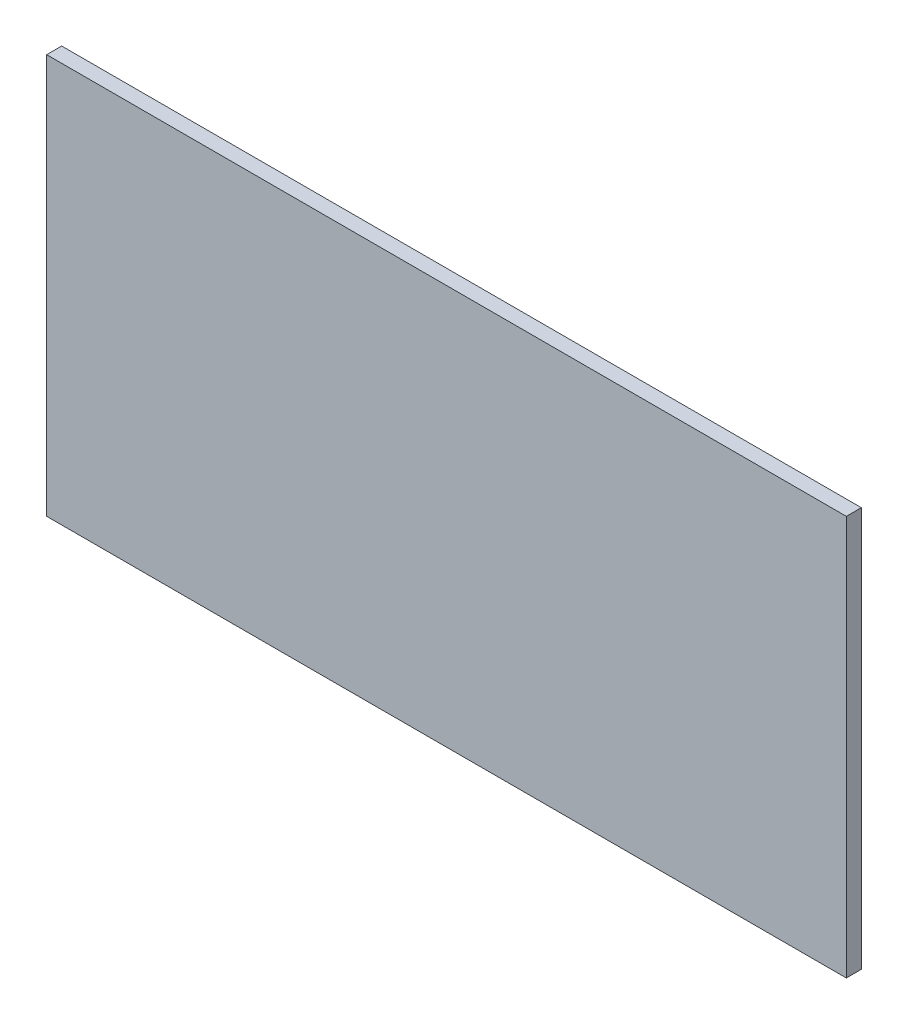
ISO-10303-21;
HEADER;
FILE_DESCRIPTION(('STEP AP214'),'2;1');
FILE_NAME('part.step','',(''),(''),'','','');
FILE_SCHEMA(('AUTOMOTIVE_DESIGN { 1 0 10303 214 1 1 1 1 }'));
ENDSEC;
DATA;
#1=APPLICATION_CONTEXT('core data for automotive mechanical design processes');
#2=APPLICATION_PROTOCOL_DEFINITION('international standard','automotive_design',2000,#1);
#3=PRODUCT_CONTEXT('',#1,'mechanical');
#4=PRODUCT('Part','Part','',(#3));
#5=PRODUCT_RELATED_PRODUCT_CATEGORY('part','',(#4));
#6=PRODUCT_DEFINITION_FORMATION('','',#4);
#7=PRODUCT_DEFINITION_CONTEXT('part definition',#1,'design');
#8=PRODUCT_DEFINITION('design','',#6,#7);
#9=PRODUCT_DEFINITION_SHAPE('','',#8);
#10=(LENGTH_UNIT() NAMED_UNIT(*) SI_UNIT(.MILLI.,.METRE.));
#11=(NAMED_UNIT(*) PLANE_ANGLE_UNIT() SI_UNIT($,.RADIAN.));
#12=(NAMED_UNIT(*) SI_UNIT($,.STERADIAN.) SOLID_ANGLE_UNIT());
#13=UNCERTAINTY_MEASURE_WITH_UNIT(LENGTH_MEASURE(1.E-05),#10,'distance_accuracy_value','');
#14=(GEOMETRIC_REPRESENTATION_CONTEXT(3) GLOBAL_UNCERTAINTY_ASSIGNED_CONTEXT((#13)) GLOBAL_UNIT_ASSIGNED_CONTEXT((#10,
#11,#12)) REPRESENTATION_CONTEXT('',''));
#15=CARTESIAN_POINT('',(0.,0.,0.));
#16=DIRECTION('',(0.,0.,1.));
#17=DIRECTION('',(1.,0.,0.));
#18=AXIS2_PLACEMENT_3D('',#15,#16,#17);
#19=CARTESIAN_POINT('',(-66.3026111073213,-35.0632949546412,3.));
#20=DIRECTION('',(0.,1.,0.));
#21=DIRECTION('',(0.,0.,1.));
#22=AXIS2_PLACEMENT_3D('',#19,#20,#21);
#23=PLANE('',#22);
#24=DIRECTION('',(1.,0.,0.));
#25=VECTOR('',#24,1.);
#26=CARTESIAN_POINT('',(-66.3026111073213,-35.0632949546412,0.));
#27=LINE('',#26,#25);
#28=CARTESIAN_POINT('',(-66.3026111073213,-35.0632949546412,0.));
#29=VERTEX_POINT('',#28);
#30=CARTESIAN_POINT('',(93.6973888926787,-35.0632949546412,0.));
#31=VERTEX_POINT('',#30);
#32=EDGE_CURVE('E95',#29,#31,#27,.T.);
#33=ORIENTED_EDGE('',*,*,#32,.T.);
#34=DIRECTION('',(0.,0.,-1.));
#35=VECTOR('',#34,1.);
#36=CARTESIAN_POINT('',(93.6973888926787,-35.0632949546412,3.));
#37=LINE('',#36,#35);
#38=CARTESIAN_POINT('',(93.6973888926787,-35.0632949546412,3.));
#39=VERTEX_POINT('',#38);
#40=EDGE_CURVE('E11',#39,#31,#37,.T.);
#41=ORIENTED_EDGE('',*,*,#40,.F.);
#42=DIRECTION('',(1.,0.,0.));
#43=VECTOR('',#42,1.);
#44=CARTESIAN_POINT('',(-66.3026111073213,-35.0632949546412,3.));
#45=LINE('',#44,#43);
#46=CARTESIAN_POINT('',(-66.3026111073213,-35.0632949546412,3.));
#47=VERTEX_POINT('',#46);
#48=EDGE_CURVE('E72',#47,#39,#45,.T.);
#49=ORIENTED_EDGE('',*,*,#48,.F.);
#50=DIRECTION('',(0.,0.,-1.));
#51=VECTOR('',#50,1.);
#52=CARTESIAN_POINT('',(-66.3026111073213,-35.0632949546412,3.));
#53=LINE('',#52,#51);
#54=EDGE_CURVE('E91',#47,#29,#53,.T.);
#55=ORIENTED_EDGE('',*,*,#54,.T.);
#56=EDGE_LOOP('',(#33,#41,#49,#55));
#57=FACE_BOUND('',#56,.T.);
#58=ADVANCED_FACE('F33',(#57),#23,.F.);
#59=CARTESIAN_POINT('',(93.6973888926786,44.9367050453588,3.));
#60=DIRECTION('',(1.,0.,0.));
#61=DIRECTION('',(0.,1.,0.));
#62=AXIS2_PLACEMENT_3D('',#59,#60,#61);
#63=PLANE('',#62);
#64=DIRECTION('',(0.,-1.,0.));
#65=VECTOR('',#64,1.);
#66=CARTESIAN_POINT('',(93.6973888926786,44.9367050453588,0.));
#67=LINE('',#66,#65);
#68=CARTESIAN_POINT('',(93.6973888926786,44.9367050453588,0.));
#69=VERTEX_POINT('',#68);
#70=EDGE_CURVE('E81',#69,#31,#67,.T.);
#71=ORIENTED_EDGE('',*,*,#70,.F.);
#72=DIRECTION('',(0.,0.,-1.));
#73=VECTOR('',#72,1.);
#74=CARTESIAN_POINT('',(93.6973888926786,44.9367050453588,3.));
#75=LINE('',#74,#73);
#76=CARTESIAN_POINT('',(93.6973888926786,44.9367050453588,3.));
#77=VERTEX_POINT('',#76);
#78=EDGE_CURVE('E41',#77,#69,#75,.T.);
#79=ORIENTED_EDGE('',*,*,#78,.F.);
#80=DIRECTION('',(0.,-1.,0.));
#81=VECTOR('',#80,1.);
#82=CARTESIAN_POINT('',(93.6973888926786,44.9367050453588,3.));
#83=LINE('',#82,#81);
#84=EDGE_CURVE('E79',#77,#39,#83,.T.);
#85=ORIENTED_EDGE('',*,*,#84,.T.);
#86=ORIENTED_EDGE('',*,*,#40,.T.);
#87=EDGE_LOOP('',(#71,#79,#85,#86));
#88=FACE_BOUND('',#87,.T.);
#89=ADVANCED_FACE('F78',(#88),#63,.T.);
#90=CARTESIAN_POINT('',(-66.3026111073214,44.9367050453588,3.));
#91=DIRECTION('',(0.,1.,0.));
#92=DIRECTION('',(0.,0.,1.));
#93=AXIS2_PLACEMENT_3D('',#90,#91,#92);
#94=PLANE('',#93);
#95=DIRECTION('',(1.,0.,0.));
#96=VECTOR('',#95,1.);
#97=CARTESIAN_POINT('',(-66.3026111073214,44.9367050453588,0.));
#98=LINE('',#97,#96);
#99=CARTESIAN_POINT('',(-66.3026111073214,44.9367050453588,0.));
#100=VERTEX_POINT('',#99);
#101=EDGE_CURVE('E99',#100,#69,#98,.T.);
#102=ORIENTED_EDGE('',*,*,#101,.F.);
#103=DIRECTION('',(0.,0.,-1.));
#104=VECTOR('',#103,1.);
#105=CARTESIAN_POINT('',(-66.3026111073214,44.9367050453588,3.));
#106=LINE('',#105,#104);
#107=CARTESIAN_POINT('',(-66.3026111073214,44.9367050453588,3.));
#108=VERTEX_POINT('',#107);
#109=EDGE_CURVE('E64',#108,#100,#106,.T.);
#110=ORIENTED_EDGE('',*,*,#109,.F.);
#111=DIRECTION('',(1.,0.,0.));
#112=VECTOR('',#111,1.);
#113=CARTESIAN_POINT('',(-66.3026111073214,44.9367050453588,3.));
#114=LINE('',#113,#112);
#115=EDGE_CURVE('E87',#108,#77,#114,.T.);
#116=ORIENTED_EDGE('',*,*,#115,.T.);
#117=ORIENTED_EDGE('',*,*,#78,.T.);
#118=EDGE_LOOP('',(#102,#110,#116,#117));
#119=FACE_BOUND('',#118,.T.);
#120=ADVANCED_FACE('F89',(#119),#94,.T.);
#121=CARTESIAN_POINT('',(-66.3026111073214,44.9367050453588,3.));
#122=DIRECTION('',(1.,0.,0.));
#123=DIRECTION('',(0.,1.,0.));
#124=AXIS2_PLACEMENT_3D('',#121,#122,#123);
#125=PLANE('',#124);
#126=DIRECTION('',(0.,-1.,0.));
#127=VECTOR('',#126,1.);
#128=CARTESIAN_POINT('',(-66.3026111073214,44.9367050453588,0.));
#129=LINE('',#128,#127);
#130=EDGE_CURVE('E67',#100,#29,#129,.T.);
#131=ORIENTED_EDGE('',*,*,#130,.T.);
#132=ORIENTED_EDGE('',*,*,#54,.F.);
#133=DIRECTION('',(0.,-1.,0.));
#134=VECTOR('',#133,1.);
#135=CARTESIAN_POINT('',(-66.3026111073214,44.9367050453588,3.));
#136=LINE('',#135,#134);
#137=EDGE_CURVE('E49',#108,#47,#136,.T.);
#138=ORIENTED_EDGE('',*,*,#137,.F.);
#139=ORIENTED_EDGE('',*,*,#109,.T.);
#140=EDGE_LOOP('',(#131,#132,#138,#139));
#141=FACE_BOUND('',#140,.T.);
#142=ADVANCED_FACE('F112',(#141),#125,.F.);
#143=CARTESIAN_POINT('',(0.,0.,3.));
#144=DIRECTION('',(0.,0.,-1.));
#145=DIRECTION('',(-1.,0.,0.));
#146=AXIS2_PLACEMENT_3D('',#143,#144,#145);
#147=PLANE('',#146);
#148=ORIENTED_EDGE('',*,*,#48,.T.);
#149=ORIENTED_EDGE('',*,*,#84,.F.);
#150=ORIENTED_EDGE('',*,*,#115,.F.);
#151=ORIENTED_EDGE('',*,*,#137,.T.);
#152=EDGE_LOOP('',(#148,#149,#150,#151));
#153=FACE_BOUND('',#152,.T.);
#154=ADVANCED_FACE('F86',(#153),#147,.F.);
#155=CARTESIAN_POINT('',(0.,0.,0.));
#156=DIRECTION('',(0.,0.,-1.));
#157=DIRECTION('',(-1.,0.,0.));
#158=AXIS2_PLACEMENT_3D('',#155,#156,#157);
#159=PLANE('',#158);
#160=ORIENTED_EDGE('',*,*,#32,.F.);
#161=ORIENTED_EDGE('',*,*,#130,.F.);
#162=ORIENTED_EDGE('',*,*,#101,.T.);
#163=ORIENTED_EDGE('',*,*,#70,.T.);
#164=EDGE_LOOP('',(#160,#161,#162,#163));
#165=FACE_BOUND('',#164,.T.);
#166=ADVANCED_FACE('F106',(#165),#159,.T.);
#167=CLOSED_SHELL('',(#58,#89,#120,#142,#154,#166));
#168=MANIFOLD_SOLID_BREP('B2',#167);
#169=ADVANCED_BREP_SHAPE_REPRESENTATION('',(#18,#168),#14);
#170=SHAPE_DEFINITION_REPRESENTATION(#9,#169);
ENDSEC;
END-ISO-10303-21;
